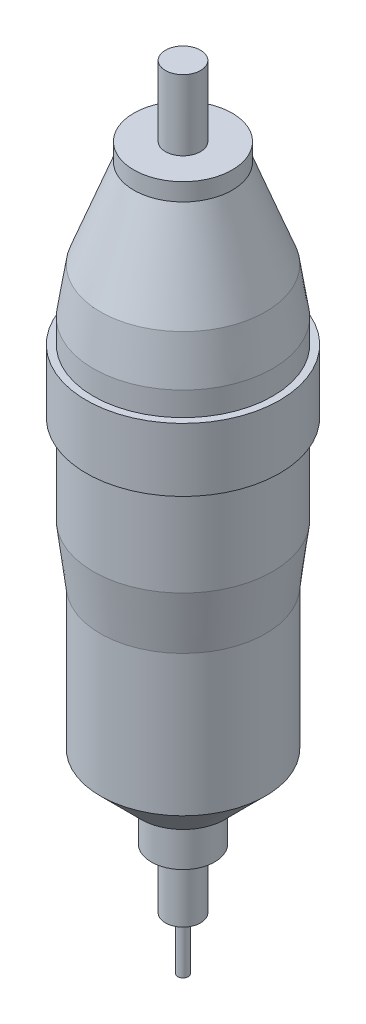
ISO-10303-21;
HEADER;
FILE_DESCRIPTION(('STEP AP214'),'2;1');
FILE_NAME('part.step','',(''),(''),'','','');
FILE_SCHEMA(('AUTOMOTIVE_DESIGN { 1 0 10303 214 1 1 1 1 }'));
ENDSEC;
DATA;
#1=APPLICATION_CONTEXT('core data for automotive mechanical design processes');
#2=APPLICATION_PROTOCOL_DEFINITION('international standard','automotive_design',2000,#1);
#3=PRODUCT_CONTEXT('',#1,'mechanical');
#4=PRODUCT('Part','Part','',(#3));
#5=PRODUCT_RELATED_PRODUCT_CATEGORY('part','',(#4));
#6=PRODUCT_DEFINITION_FORMATION('','',#4);
#7=PRODUCT_DEFINITION_CONTEXT('part definition',#1,'design');
#8=PRODUCT_DEFINITION('design','',#6,#7);
#9=PRODUCT_DEFINITION_SHAPE('','',#8);
#10=(LENGTH_UNIT() NAMED_UNIT(*) SI_UNIT(.MILLI.,.METRE.));
#11=(NAMED_UNIT(*) PLANE_ANGLE_UNIT() SI_UNIT($,.RADIAN.));
#12=(NAMED_UNIT(*) SI_UNIT($,.STERADIAN.) SOLID_ANGLE_UNIT());
#13=UNCERTAINTY_MEASURE_WITH_UNIT(LENGTH_MEASURE(1.E-05),#10,'distance_accuracy_value','');
#14=(GEOMETRIC_REPRESENTATION_CONTEXT(3) GLOBAL_UNCERTAINTY_ASSIGNED_CONTEXT((#13)) GLOBAL_UNIT_ASSIGNED_CONTEXT((#10,
#11,#12)) REPRESENTATION_CONTEXT('',''));
#15=CARTESIAN_POINT('',(0.,0.,0.));
#16=DIRECTION('',(0.,0.,1.));
#17=DIRECTION('',(1.,0.,0.));
#18=AXIS2_PLACEMENT_3D('',#15,#16,#17);
#19=CARTESIAN_POINT('',(0.,-103.899415170283,0.));
#20=DIRECTION('',(0.,1.,0.));
#21=DIRECTION('',(-1.,0.,0.));
#22=AXIS2_PLACEMENT_3D('',#19,#20,#21);
#23=PLANE('',#22);
#24=CARTESIAN_POINT('',(0.,-103.899415170283,0.));
#25=DIRECTION('',(0.,1.,0.));
#26=DIRECTION('',(-1.,0.,0.));
#27=AXIS2_PLACEMENT_3D('',#24,#25,#26);
#28=CIRCLE('',#27,5.);
#29=CARTESIAN_POINT('',(-4.99999999999998,-103.899415170283,0.));
#30=VERTEX_POINT('',#29);
#31=EDGE_CURVE('E42',#30,#30,#28,.T.);
#32=ORIENTED_EDGE('',*,*,#31,.F.);
#33=EDGE_LOOP('',(#32));
#34=FACE_BOUND('',#33,.T.);
#35=CARTESIAN_POINT('',(0.,-103.899415170283,0.));
#36=DIRECTION('',(0.,1.,0.));
#37=DIRECTION('',(-1.,0.,0.));
#38=AXIS2_PLACEMENT_3D('',#35,#36,#37);
#39=CIRCLE('',#38,1.5);
#40=CARTESIAN_POINT('',(-1.49999999999998,-103.899415170283,0.));
#41=VERTEX_POINT('',#40);
#42=EDGE_CURVE('E10',#41,#41,#39,.F.);
#43=ORIENTED_EDGE('',*,*,#42,.F.);
#44=EDGE_LOOP('',(#43));
#45=FACE_BOUND('',#44,.T.);
#46=ADVANCED_FACE('F32',(#34,#45),#23,.F.);
#47=CARTESIAN_POINT('',(0.,86.1005848297174,0.));
#48=DIRECTION('',(0.,-1.,0.));
#49=DIRECTION('',(1.,0.,0.));
#50=AXIS2_PLACEMENT_3D('',#47,#48,#49);
#51=PLANE('',#50);
#52=CARTESIAN_POINT('',(0.,86.1005848297174,0.));
#53=DIRECTION('',(0.,1.,0.));
#54=DIRECTION('',(-1.,0.,0.));
#55=AXIS2_PLACEMENT_3D('',#52,#53,#54);
#56=CIRCLE('',#55,14.);
#57=CARTESIAN_POINT('',(-14.,86.1005848297174,0.));
#58=VERTEX_POINT('',#57);
#59=EDGE_CURVE('E90',#58,#58,#56,.T.);
#60=ORIENTED_EDGE('',*,*,#59,.T.);
#61=EDGE_LOOP('',(#60));
#62=FACE_BOUND('',#61,.T.);
#63=CARTESIAN_POINT('',(0.,86.1005848297174,0.));
#64=DIRECTION('',(0.,-1.,0.));
#65=DIRECTION('',(1.,0.,0.));
#66=AXIS2_PLACEMENT_3D('',#63,#64,#65);
#67=CIRCLE('',#66,5.);
#68=CARTESIAN_POINT('',(5.,86.1005848297174,0.));
#69=VERTEX_POINT('',#68);
#70=EDGE_CURVE('E38',#69,#69,#67,.F.);
#71=ORIENTED_EDGE('',*,*,#70,.F.);
#72=EDGE_LOOP('',(#71));
#73=FACE_BOUND('',#72,.T.);
#74=ADVANCED_FACE('F115',(#62,#73),#51,.F.);
#75=CARTESIAN_POINT('',(0.,86.1005848297174,0.));
#76=DIRECTION('',(0.,1.,0.));
#77=DIRECTION('',(-1.,0.,0.));
#78=AXIS2_PLACEMENT_3D('',#75,#76,#77);
#79=CYLINDRICAL_SURFACE('',#78,5.);
#80=CARTESIAN_POINT('',(0.,-86.8994151702826,0.));
#81=DIRECTION('',(0.,1.,0.));
#82=DIRECTION('',(-1.,0.,0.));
#83=AXIS2_PLACEMENT_3D('',#80,#81,#82);
#84=CIRCLE('',#83,5.);
#85=CARTESIAN_POINT('',(-4.99999999999998,-86.8994151702826,0.));
#86=VERTEX_POINT('',#85);
#87=EDGE_CURVE('E46',#86,#86,#84,.T.);
#88=ORIENTED_EDGE('',*,*,#87,.F.);
#89=EDGE_LOOP('',(#88));
#90=FACE_BOUND('',#89,.T.);
#91=ORIENTED_EDGE('',*,*,#31,.T.);
#92=EDGE_LOOP('',(#91));
#93=FACE_BOUND('',#92,.T.);
#94=ADVANCED_FACE('F120',(#90,#93),#79,.T.);
#95=CARTESIAN_POINT('',(9.00000000000002,-86.8994151702826,0.));
#96=DIRECTION('',(0.,1.,0.));
#97=DIRECTION('',(-1.,0.,0.));
#98=AXIS2_PLACEMENT_3D('',#95,#96,#97);
#99=PLANE('',#98);
#100=CARTESIAN_POINT('',(0.,-86.8994151702826,0.));
#101=DIRECTION('',(0.,1.,0.));
#102=DIRECTION('',(-1.,0.,0.));
#103=AXIS2_PLACEMENT_3D('',#100,#101,#102);
#104=CIRCLE('',#103,9.);
#105=CARTESIAN_POINT('',(-8.99999999999998,-86.8994151702826,0.));
#106=VERTEX_POINT('',#105);
#107=EDGE_CURVE('E51',#106,#106,#104,.T.);
#108=ORIENTED_EDGE('',*,*,#107,.F.);
#109=EDGE_LOOP('',(#108));
#110=FACE_BOUND('',#109,.T.);
#111=ORIENTED_EDGE('',*,*,#87,.T.);
#112=EDGE_LOOP('',(#111));
#113=FACE_BOUND('',#112,.T.);
#114=ADVANCED_FACE('F127',(#110,#113),#99,.F.);
#115=CARTESIAN_POINT('',(0.,86.1005848297174,0.));
#116=DIRECTION('',(0.,1.,0.));
#117=DIRECTION('',(-1.,0.,0.));
#118=AXIS2_PLACEMENT_3D('',#115,#116,#117);
#119=CYLINDRICAL_SURFACE('',#118,9.);
#120=CARTESIAN_POINT('',(0.,-74.8994151702826,0.));
#121=DIRECTION('',(0.,1.,0.));
#122=DIRECTION('',(-1.,0.,0.));
#123=AXIS2_PLACEMENT_3D('',#120,#121,#122);
#124=CIRCLE('',#123,9.);
#125=CARTESIAN_POINT('',(-8.99999999999998,-74.8994151702826,0.));
#126=VERTEX_POINT('',#125);
#127=EDGE_CURVE('E54',#126,#126,#124,.T.);
#128=ORIENTED_EDGE('',*,*,#127,.F.);
#129=EDGE_LOOP('',(#128));
#130=FACE_BOUND('',#129,.T.);
#131=ORIENTED_EDGE('',*,*,#107,.T.);
#132=EDGE_LOOP('',(#131));
#133=FACE_BOUND('',#132,.T.);
#134=ADVANCED_FACE('F132',(#130,#133),#119,.T.);
#135=CARTESIAN_POINT('',(12.,-74.8994151702826,0.));
#136=DIRECTION('',(0.,1.,0.));
#137=DIRECTION('',(-1.,0.,0.));
#138=AXIS2_PLACEMENT_3D('',#135,#136,#137);
#139=PLANE('',#138);
#140=CARTESIAN_POINT('',(0.,-74.8994151702826,0.));
#141=DIRECTION('',(0.,1.,0.));
#142=DIRECTION('',(-1.,0.,0.));
#143=AXIS2_PLACEMENT_3D('',#140,#141,#142);
#144=CIRCLE('',#143,12.);
#145=CARTESIAN_POINT('',(-12.,-74.8994151702826,0.));
#146=VERTEX_POINT('',#145);
#147=EDGE_CURVE('E57',#146,#146,#144,.T.);
#148=ORIENTED_EDGE('',*,*,#147,.F.);
#149=EDGE_LOOP('',(#148));
#150=FACE_BOUND('',#149,.T.);
#151=ORIENTED_EDGE('',*,*,#127,.T.);
#152=EDGE_LOOP('',(#151));
#153=FACE_BOUND('',#152,.T.);
#154=ADVANCED_FACE('F139',(#150,#153),#139,.F.);
#155=CARTESIAN_POINT('',(0.,-74.8994151702826,0.));
#156=DIRECTION('',(0.,1.,0.));
#157=DIRECTION('',(-1.,0.,0.));
#158=AXIS2_PLACEMENT_3D('',#155,#156,#157);
#159=CONICAL_SURFACE('',#158,12.,0.785398163397451);
#160=CARTESIAN_POINT('',(0.,-63.3994151702827,0.));
#161=DIRECTION('',(0.,1.,0.));
#162=DIRECTION('',(-1.,0.,0.));
#163=AXIS2_PLACEMENT_3D('',#160,#161,#162);
#164=CIRCLE('',#163,23.5);
#165=CARTESIAN_POINT('',(-23.5,-63.3994151702827,0.));
#166=VERTEX_POINT('',#165);
#167=EDGE_CURVE('E60',#166,#166,#164,.T.);
#168=ORIENTED_EDGE('',*,*,#167,.F.);
#169=EDGE_LOOP('',(#168));
#170=FACE_BOUND('',#169,.T.);
#171=ORIENTED_EDGE('',*,*,#147,.T.);
#172=EDGE_LOOP('',(#171));
#173=FACE_BOUND('',#172,.T.);
#174=ADVANCED_FACE('F143',(#170,#173),#159,.T.);
#175=CARTESIAN_POINT('',(0.,86.1005848297174,0.));
#176=DIRECTION('',(0.,1.,0.));
#177=DIRECTION('',(-1.,0.,0.));
#178=AXIS2_PLACEMENT_3D('',#175,#176,#177);
#179=CYLINDRICAL_SURFACE('',#178,23.5);
#180=CARTESIAN_POINT('',(0.,-23.3994151702827,0.));
#181=DIRECTION('',(0.,1.,0.));
#182=DIRECTION('',(-1.,0.,0.));
#183=AXIS2_PLACEMENT_3D('',#180,#181,#182);
#184=CIRCLE('',#183,23.5);
#185=CARTESIAN_POINT('',(-23.5,-23.3994151702827,0.));
#186=VERTEX_POINT('',#185);
#187=EDGE_CURVE('E63',#186,#186,#184,.T.);
#188=ORIENTED_EDGE('',*,*,#187,.F.);
#189=EDGE_LOOP('',(#188));
#190=FACE_BOUND('',#189,.T.);
#191=ORIENTED_EDGE('',*,*,#167,.T.);
#192=EDGE_LOOP('',(#191));
#193=FACE_BOUND('',#192,.T.);
#194=ADVANCED_FACE('F147',(#190,#193),#179,.T.);
#195=CARTESIAN_POINT('',(0.,-23.3994151702827,0.));
#196=DIRECTION('',(0.,1.,0.));
#197=DIRECTION('',(-1.,0.,0.));
#198=AXIS2_PLACEMENT_3D('',#195,#196,#197);
#199=CONICAL_SURFACE('',#198,23.5,0.122173047639603);
#200=CARTESIAN_POINT('',(0.,-7.11072231433354,0.));
#201=DIRECTION('',(0.,1.,0.));
#202=DIRECTION('',(-1.,0.,0.));
#203=AXIS2_PLACEMENT_3D('',#200,#201,#202);
#204=CIRCLE('',#203,25.5);
#205=CARTESIAN_POINT('',(-25.5,-7.11072231433355,0.));
#206=VERTEX_POINT('',#205);
#207=EDGE_CURVE('E66',#206,#206,#204,.T.);
#208=ORIENTED_EDGE('',*,*,#207,.F.);
#209=EDGE_LOOP('',(#208));
#210=FACE_BOUND('',#209,.T.);
#211=ORIENTED_EDGE('',*,*,#187,.T.);
#212=EDGE_LOOP('',(#211));
#213=FACE_BOUND('',#212,.T.);
#214=ADVANCED_FACE('F151',(#210,#213),#199,.T.);
#215=CARTESIAN_POINT('',(0.,86.1005848297174,0.));
#216=DIRECTION('',(0.,1.,0.));
#217=DIRECTION('',(-1.,0.,0.));
#218=AXIS2_PLACEMENT_3D('',#215,#216,#217);
#219=CYLINDRICAL_SURFACE('',#218,25.5);
#220=CARTESIAN_POINT('',(0.,18.1005848297174,0.));
#221=DIRECTION('',(0.,1.,0.));
#222=DIRECTION('',(-1.,0.,0.));
#223=AXIS2_PLACEMENT_3D('',#220,#221,#222);
#224=CIRCLE('',#223,25.5);
#225=CARTESIAN_POINT('',(-25.5,18.1005848297174,0.));
#226=VERTEX_POINT('',#225);
#227=EDGE_CURVE('E69',#226,#226,#224,.T.);
#228=ORIENTED_EDGE('',*,*,#227,.F.);
#229=EDGE_LOOP('',(#228));
#230=FACE_BOUND('',#229,.T.);
#231=ORIENTED_EDGE('',*,*,#207,.T.);
#232=EDGE_LOOP('',(#231));
#233=FACE_BOUND('',#232,.T.);
#234=ADVANCED_FACE('F155',(#230,#233),#219,.T.);
#235=CARTESIAN_POINT('',(25.5,18.1005848297174,0.));
#236=DIRECTION('',(0.,1.,0.));
#237=DIRECTION('',(-1.,0.,0.));
#238=AXIS2_PLACEMENT_3D('',#235,#236,#237);
#239=PLANE('',#238);
#240=CARTESIAN_POINT('',(0.,18.1005848297174,0.));
#241=DIRECTION('',(0.,1.,0.));
#242=DIRECTION('',(-1.,0.,0.));
#243=AXIS2_PLACEMENT_3D('',#240,#241,#242);
#244=CIRCLE('',#243,27.5);
#245=CARTESIAN_POINT('',(-27.5,18.1005848297174,0.));
#246=VERTEX_POINT('',#245);
#247=EDGE_CURVE('E72',#246,#246,#244,.T.);
#248=ORIENTED_EDGE('',*,*,#247,.F.);
#249=EDGE_LOOP('',(#248));
#250=FACE_BOUND('',#249,.T.);
#251=ORIENTED_EDGE('',*,*,#227,.T.);
#252=EDGE_LOOP('',(#251));
#253=FACE_BOUND('',#252,.T.);
#254=ADVANCED_FACE('F159',(#250,#253),#239,.F.);
#255=CARTESIAN_POINT('',(0.,86.1005848297174,0.));
#256=DIRECTION('',(0.,1.,0.));
#257=DIRECTION('',(-1.,0.,0.));
#258=AXIS2_PLACEMENT_3D('',#255,#256,#257);
#259=CYLINDRICAL_SURFACE('',#258,27.5);
#260=CARTESIAN_POINT('',(0.,36.1005848297174,0.));
#261=DIRECTION('',(0.,1.,0.));
#262=DIRECTION('',(-1.,0.,0.));
#263=AXIS2_PLACEMENT_3D('',#260,#261,#262);
#264=CIRCLE('',#263,27.5);
#265=CARTESIAN_POINT('',(-27.5,36.1005848297174,0.));
#266=VERTEX_POINT('',#265);
#267=EDGE_CURVE('E75',#266,#266,#264,.T.);
#268=ORIENTED_EDGE('',*,*,#267,.F.);
#269=EDGE_LOOP('',(#268));
#270=FACE_BOUND('',#269,.T.);
#271=ORIENTED_EDGE('',*,*,#247,.T.);
#272=EDGE_LOOP('',(#271));
#273=FACE_BOUND('',#272,.T.);
#274=ADVANCED_FACE('F163',(#270,#273),#259,.T.);
#275=CARTESIAN_POINT('',(27.5,36.1005848297174,0.));
#276=DIRECTION('',(0.,-1.,0.));
#277=DIRECTION('',(1.,0.,0.));
#278=AXIS2_PLACEMENT_3D('',#275,#276,#277);
#279=PLANE('',#278);
#280=CARTESIAN_POINT('',(0.,36.1005848297174,0.));
#281=DIRECTION('',(0.,1.,0.));
#282=DIRECTION('',(-1.,0.,0.));
#283=AXIS2_PLACEMENT_3D('',#280,#281,#282);
#284=CIRCLE('',#283,25.5);
#285=CARTESIAN_POINT('',(-25.5,36.1005848297174,0.));
#286=VERTEX_POINT('',#285);
#287=EDGE_CURVE('E78',#286,#286,#284,.T.);
#288=ORIENTED_EDGE('',*,*,#287,.F.);
#289=EDGE_LOOP('',(#288));
#290=FACE_BOUND('',#289,.T.);
#291=ORIENTED_EDGE('',*,*,#267,.T.);
#292=EDGE_LOOP('',(#291));
#293=FACE_BOUND('',#292,.T.);
#294=ADVANCED_FACE('F167',(#290,#293),#279,.F.);
#295=CARTESIAN_POINT('',(0.,86.1005848297174,0.));
#296=DIRECTION('',(0.,1.,0.));
#297=DIRECTION('',(-1.,0.,0.));
#298=AXIS2_PLACEMENT_3D('',#295,#296,#297);
#299=CYLINDRICAL_SURFACE('',#298,25.5);
#300=CARTESIAN_POINT('',(0.,42.8892776856665,0.));
#301=DIRECTION('',(0.,1.,0.));
#302=DIRECTION('',(-1.,0.,0.));
#303=AXIS2_PLACEMENT_3D('',#300,#301,#302);
#304=CIRCLE('',#303,25.5);
#305=CARTESIAN_POINT('',(-25.5,42.8892776856665,0.));
#306=VERTEX_POINT('',#305);
#307=EDGE_CURVE('E81',#306,#306,#304,.T.);
#308=ORIENTED_EDGE('',*,*,#307,.F.);
#309=EDGE_LOOP('',(#308));
#310=FACE_BOUND('',#309,.T.);
#311=ORIENTED_EDGE('',*,*,#287,.T.);
#312=EDGE_LOOP('',(#311));
#313=FACE_BOUND('',#312,.T.);
#314=ADVANCED_FACE('F171',(#310,#313),#299,.T.);
#315=CARTESIAN_POINT('',(0.,42.8892776856665,0.));
#316=DIRECTION('',(0.,-1.,0.));
#317=DIRECTION('',(1.,0.,0.));
#318=AXIS2_PLACEMENT_3D('',#315,#316,#317);
#319=CONICAL_SURFACE('',#318,25.5,0.152649328395273);
#320=CARTESIAN_POINT('',(0.,55.8892776856665,0.));
#321=DIRECTION('',(0.,1.,0.));
#322=DIRECTION('',(-1.,0.,0.));
#323=AXIS2_PLACEMENT_3D('',#320,#321,#322);
#324=CIRCLE('',#323,23.4999999999999);
#325=CARTESIAN_POINT('',(-23.4999999999999,55.8892776856665,0.));
#326=VERTEX_POINT('',#325);
#327=EDGE_CURVE('E84',#326,#326,#324,.T.);
#328=ORIENTED_EDGE('',*,*,#327,.F.);
#329=EDGE_LOOP('',(#328));
#330=FACE_BOUND('',#329,.T.);
#331=ORIENTED_EDGE('',*,*,#307,.T.);
#332=EDGE_LOOP('',(#331));
#333=FACE_BOUND('',#332,.T.);
#334=ADVANCED_FACE('F175',(#330,#333),#319,.T.);
#335=CARTESIAN_POINT('',(0.,55.8892776856665,0.));
#336=DIRECTION('',(0.,-1.,0.));
#337=DIRECTION('',(1.,0.,0.));
#338=AXIS2_PLACEMENT_3D('',#335,#336,#337);
#339=CONICAL_SURFACE('',#338,23.4999999999999,0.360360997965965);
#340=CARTESIAN_POINT('',(0.,81.1005848297174,0.));
#341=DIRECTION('',(0.,1.,0.));
#342=DIRECTION('',(-1.,0.,0.));
#343=AXIS2_PLACEMENT_3D('',#340,#341,#342);
#344=CIRCLE('',#343,14.);
#345=CARTESIAN_POINT('',(-14.,81.1005848297174,0.));
#346=VERTEX_POINT('',#345);
#347=EDGE_CURVE('E87',#346,#346,#344,.T.);
#348=ORIENTED_EDGE('',*,*,#347,.F.);
#349=EDGE_LOOP('',(#348));
#350=FACE_BOUND('',#349,.T.);
#351=ORIENTED_EDGE('',*,*,#327,.T.);
#352=EDGE_LOOP('',(#351));
#353=FACE_BOUND('',#352,.T.);
#354=ADVANCED_FACE('F179',(#350,#353),#339,.T.);
#355=CARTESIAN_POINT('',(0.,86.1005848297174,0.));
#356=DIRECTION('',(0.,1.,0.));
#357=DIRECTION('',(-1.,0.,0.));
#358=AXIS2_PLACEMENT_3D('',#355,#356,#357);
#359=CYLINDRICAL_SURFACE('',#358,14.);
#360=ORIENTED_EDGE('',*,*,#59,.F.);
#361=EDGE_LOOP('',(#360));
#362=FACE_BOUND('',#361,.T.);
#363=ORIENTED_EDGE('',*,*,#347,.T.);
#364=EDGE_LOOP('',(#363));
#365=FACE_BOUND('',#364,.T.);
#366=ADVANCED_FACE('F183',(#362,#365),#359,.T.);
#367=CARTESIAN_POINT('',(0.,106.100584829717,0.));
#368=DIRECTION('',(0.,-1.,0.));
#369=DIRECTION('',(1.,0.,0.));
#370=AXIS2_PLACEMENT_3D('',#367,#368,#369);
#371=CYLINDRICAL_SURFACE('',#370,5.);
#372=CARTESIAN_POINT('',(0.,106.100584829717,0.));
#373=DIRECTION('',(0.,1.,0.));
#374=DIRECTION('',(-1.,0.,0.));
#375=AXIS2_PLACEMENT_3D('',#372,#373,#374);
#376=CIRCLE('',#375,5.);
#377=CARTESIAN_POINT('',(-5.,106.100584829717,0.));
#378=VERTEX_POINT('',#377);
#379=EDGE_CURVE('E93',#378,#378,#376,.T.);
#380=ORIENTED_EDGE('',*,*,#379,.F.);
#381=EDGE_LOOP('',(#380));
#382=FACE_BOUND('',#381,.T.);
#383=ORIENTED_EDGE('',*,*,#70,.T.);
#384=EDGE_LOOP('',(#383));
#385=FACE_BOUND('',#384,.T.);
#386=ADVANCED_FACE('F111',(#382,#385),#371,.T.);
#387=CARTESIAN_POINT('',(0.,106.100584829717,0.));
#388=DIRECTION('',(0.,1.,0.));
#389=DIRECTION('',(-1.,0.,0.));
#390=AXIS2_PLACEMENT_3D('',#387,#388,#389);
#391=PLANE('',#390);
#392=ORIENTED_EDGE('',*,*,#379,.T.);
#393=EDGE_LOOP('',(#392));
#394=FACE_BOUND('',#393,.T.);
#395=ADVANCED_FACE('F104',(#394),#391,.T.);
#396=CARTESIAN_POINT('',(0.,-118.899415170283,0.));
#397=DIRECTION('',(0.,1.,0.));
#398=DIRECTION('',(-1.,0.,0.));
#399=AXIS2_PLACEMENT_3D('',#396,#397,#398);
#400=CYLINDRICAL_SURFACE('',#399,1.5);
#401=CARTESIAN_POINT('',(0.,-118.899415170283,0.));
#402=DIRECTION('',(0.,-1.,0.));
#403=DIRECTION('',(1.,0.,0.));
#404=AXIS2_PLACEMENT_3D('',#401,#402,#403);
#405=CIRCLE('',#404,1.5);
#406=CARTESIAN_POINT('',(1.50000000000002,-118.899415170283,0.));
#407=VERTEX_POINT('',#406);
#408=EDGE_CURVE('E96',#407,#407,#405,.T.);
#409=ORIENTED_EDGE('',*,*,#408,.F.);
#410=EDGE_LOOP('',(#409));
#411=FACE_BOUND('',#410,.T.);
#412=ORIENTED_EDGE('',*,*,#42,.T.);
#413=EDGE_LOOP('',(#412));
#414=FACE_BOUND('',#413,.T.);
#415=ADVANCED_FACE('F102',(#411,#414),#400,.T.);
#416=CARTESIAN_POINT('',(0.,-118.899415170283,0.));
#417=DIRECTION('',(0.,-1.,0.));
#418=DIRECTION('',(1.,0.,0.));
#419=AXIS2_PLACEMENT_3D('',#416,#417,#418);
#420=PLANE('',#419);
#421=ORIENTED_EDGE('',*,*,#408,.T.);
#422=EDGE_LOOP('',(#421));
#423=FACE_BOUND('',#422,.T.);
#424=ADVANCED_FACE('F100',(#423),#420,.T.);
#425=CLOSED_SHELL('',(#46,#74,#94,#114,#134,#154,#174,#194,#214,#234,#254,#274,#294,#314,#334,
#354,#366,#386,#395,#415,#424));
#426=MANIFOLD_SOLID_BREP('B2',#425);
#427=ADVANCED_BREP_SHAPE_REPRESENTATION('',(#18,#426),#14);
#428=SHAPE_DEFINITION_REPRESENTATION(#9,#427);
ENDSEC;
END-ISO-10303-21;
